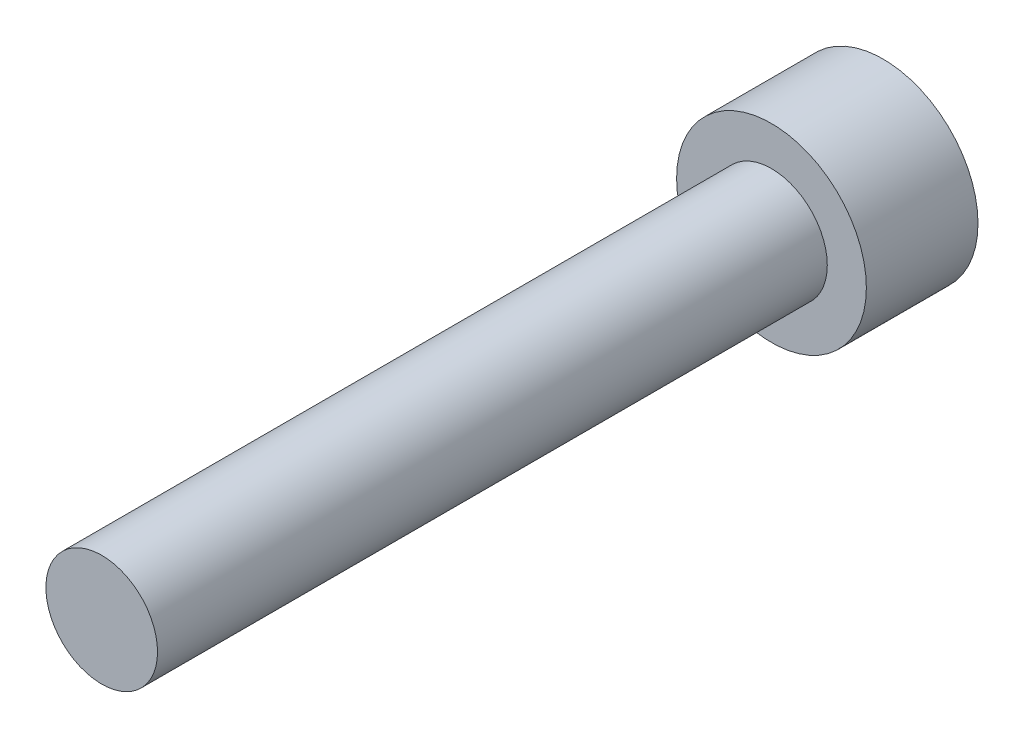
ISO-10303-21;
HEADER;
FILE_DESCRIPTION(('STEP AP214'),'2;1');
FILE_NAME('part.step','',(''),(''),'','','');
FILE_SCHEMA(('AUTOMOTIVE_DESIGN { 1 0 10303 214 1 1 1 1 }'));
ENDSEC;
DATA;
#1=APPLICATION_CONTEXT('core data for automotive mechanical design processes');
#2=APPLICATION_PROTOCOL_DEFINITION('international standard','automotive_design',2000,#1);
#3=PRODUCT_CONTEXT('',#1,'mechanical');
#4=PRODUCT('Part','Part','',(#3));
#5=PRODUCT_RELATED_PRODUCT_CATEGORY('part','',(#4));
#6=PRODUCT_DEFINITION_FORMATION('','',#4);
#7=PRODUCT_DEFINITION_CONTEXT('part definition',#1,'design');
#8=PRODUCT_DEFINITION('design','',#6,#7);
#9=PRODUCT_DEFINITION_SHAPE('','',#8);
#10=(LENGTH_UNIT() NAMED_UNIT(*) SI_UNIT(.MILLI.,.METRE.));
#11=(NAMED_UNIT(*) PLANE_ANGLE_UNIT() SI_UNIT($,.RADIAN.));
#12=(NAMED_UNIT(*) SI_UNIT($,.STERADIAN.) SOLID_ANGLE_UNIT());
#13=UNCERTAINTY_MEASURE_WITH_UNIT(LENGTH_MEASURE(1.E-05),#10,'distance_accuracy_value','');
#14=(GEOMETRIC_REPRESENTATION_CONTEXT(3) GLOBAL_UNCERTAINTY_ASSIGNED_CONTEXT((#13)) GLOBAL_UNIT_ASSIGNED_CONTEXT((#10,
#11,#12)) REPRESENTATION_CONTEXT('',''));
#15=CARTESIAN_POINT('',(0.,0.,0.));
#16=DIRECTION('',(0.,0.,1.));
#17=DIRECTION('',(1.,0.,0.));
#18=AXIS2_PLACEMENT_3D('',#15,#16,#17);
#19=CARTESIAN_POINT('',(0.,0.,-5.));
#20=DIRECTION('',(0.,0.,1.));
#21=DIRECTION('',(1.,0.,0.));
#22=AXIS2_PLACEMENT_3D('',#19,#20,#21);
#23=PLANE('',#22);
#24=CARTESIAN_POINT('',(0.,0.,-5.));
#25=DIRECTION('',(0.,0.,-1.));
#26=DIRECTION('',(-1.,0.,0.));
#27=AXIS2_PLACEMENT_3D('',#24,#25,#26);
#28=CIRCLE('',#27,4.25);
#29=CARTESIAN_POINT('',(-4.25,0.,-5.));
#30=VERTEX_POINT('',#29);
#31=EDGE_CURVE('E18',#30,#30,#28,.F.);
#32=ORIENTED_EDGE('',*,*,#31,.F.);
#33=EDGE_LOOP('',(#32));
#34=FACE_BOUND('',#33,.T.);
#35=ADVANCED_FACE('F15',(#34),#23,.F.);
#36=CARTESIAN_POINT('',(0.,0.,0.));
#37=DIRECTION('',(0.,0.,-1.));
#38=DIRECTION('',(-1.,0.,0.));
#39=AXIS2_PLACEMENT_3D('',#36,#37,#38);
#40=CYLINDRICAL_SURFACE('',#39,4.25);
#41=CARTESIAN_POINT('',(0.,0.,0.));
#42=DIRECTION('',(0.,0.,-1.));
#43=DIRECTION('',(-1.,0.,0.));
#44=AXIS2_PLACEMENT_3D('',#41,#42,#43);
#45=CIRCLE('',#44,4.25);
#46=CARTESIAN_POINT('',(-4.25,0.,0.));
#47=VERTEX_POINT('',#46);
#48=EDGE_CURVE('E27',#47,#47,#45,.F.);
#49=ORIENTED_EDGE('',*,*,#48,.F.);
#50=EDGE_LOOP('',(#49));
#51=FACE_BOUND('',#50,.T.);
#52=ORIENTED_EDGE('',*,*,#31,.T.);
#53=EDGE_LOOP('',(#52));
#54=FACE_BOUND('',#53,.T.);
#55=ADVANCED_FACE('F35',(#51,#54),#40,.T.);
#56=CARTESIAN_POINT('',(0.,0.,30.));
#57=DIRECTION('',(0.,0.,1.));
#58=DIRECTION('',(1.,0.,0.));
#59=AXIS2_PLACEMENT_3D('',#56,#57,#58);
#60=PLANE('',#59);
#61=CARTESIAN_POINT('',(0.,0.,30.));
#62=DIRECTION('',(0.,0.,1.));
#63=DIRECTION('',(1.,0.,0.));
#64=AXIS2_PLACEMENT_3D('',#61,#62,#63);
#65=CIRCLE('',#64,2.5);
#66=CARTESIAN_POINT('',(2.5,0.,30.));
#67=VERTEX_POINT('',#66);
#68=EDGE_CURVE('E22',#67,#67,#65,.F.);
#69=ORIENTED_EDGE('',*,*,#68,.F.);
#70=EDGE_LOOP('',(#69));
#71=FACE_BOUND('',#70,.T.);
#72=ADVANCED_FACE('F42',(#71),#60,.T.);
#73=CARTESIAN_POINT('',(0.,0.,0.));
#74=DIRECTION('',(0.,0.,1.));
#75=DIRECTION('',(1.,0.,0.));
#76=AXIS2_PLACEMENT_3D('',#73,#74,#75);
#77=PLANE('',#76);
#78=CARTESIAN_POINT('',(0.,0.,0.));
#79=DIRECTION('',(0.,0.,1.));
#80=DIRECTION('',(1.,0.,0.));
#81=AXIS2_PLACEMENT_3D('',#78,#79,#80);
#82=CIRCLE('',#81,2.5);
#83=CARTESIAN_POINT('',(2.5,0.,0.));
#84=VERTEX_POINT('',#83);
#85=EDGE_CURVE('E10',#84,#84,#82,.T.);
#86=ORIENTED_EDGE('',*,*,#85,.F.);
#87=EDGE_LOOP('',(#86));
#88=FACE_BOUND('',#87,.T.);
#89=ORIENTED_EDGE('',*,*,#48,.T.);
#90=EDGE_LOOP('',(#89));
#91=FACE_BOUND('',#90,.T.);
#92=ADVANCED_FACE('F46',(#88,#91),#77,.T.);
#93=CARTESIAN_POINT('',(0.,0.,0.));
#94=DIRECTION('',(0.,0.,1.));
#95=DIRECTION('',(1.,0.,0.));
#96=AXIS2_PLACEMENT_3D('',#93,#94,#95);
#97=CYLINDRICAL_SURFACE('',#96,2.5);
#98=ORIENTED_EDGE('',*,*,#85,.T.);
#99=EDGE_LOOP('',(#98));
#100=FACE_BOUND('',#99,.T.);
#101=ORIENTED_EDGE('',*,*,#68,.T.);
#102=EDGE_LOOP('',(#101));
#103=FACE_BOUND('',#102,.T.);
#104=ADVANCED_FACE('F44',(#100,#103),#97,.T.);
#105=CLOSED_SHELL('',(#35,#55,#72,#92,#104));
#106=MANIFOLD_SOLID_BREP('B1',#105);
#107=ADVANCED_BREP_SHAPE_REPRESENTATION('',(#18,#106),#14);
#108=SHAPE_DEFINITION_REPRESENTATION(#9,#107);
ENDSEC;
END-ISO-10303-21;
